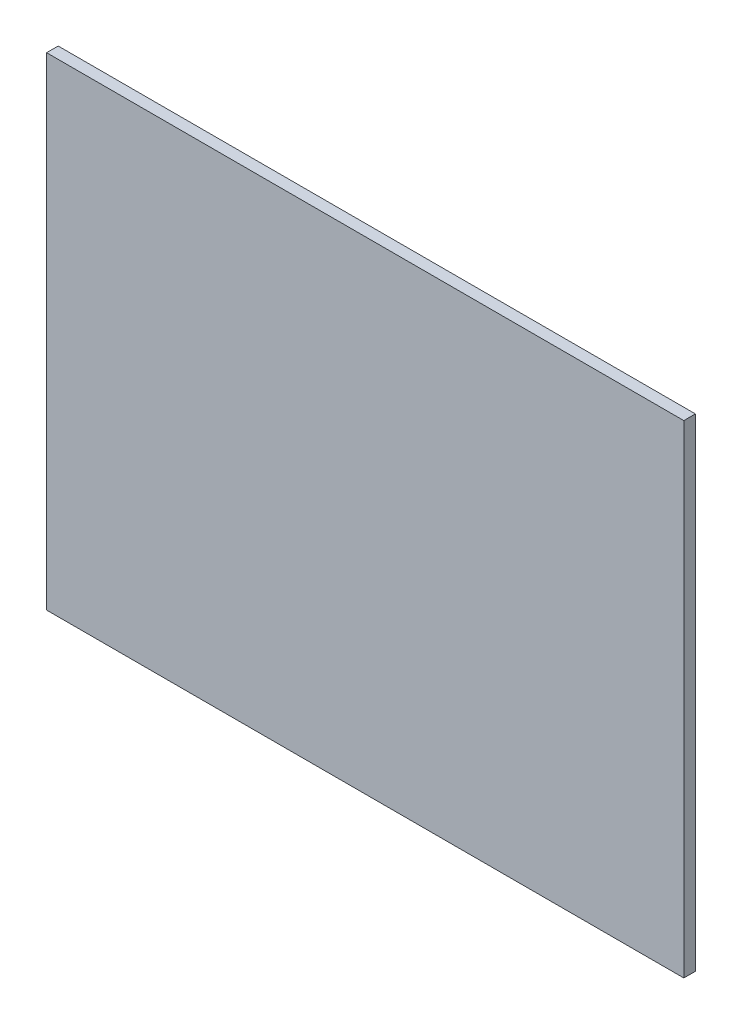
ISO-10303-21;
HEADER;
FILE_DESCRIPTION(('STEP AP214'),'2;1');
FILE_NAME('part.step','',(''),(''),'','','');
FILE_SCHEMA(('AUTOMOTIVE_DESIGN { 1 0 10303 214 1 1 1 1 }'));
ENDSEC;
DATA;
#1=APPLICATION_CONTEXT('core data for automotive mechanical design processes');
#2=APPLICATION_PROTOCOL_DEFINITION('international standard','automotive_design',2000,#1);
#3=PRODUCT_CONTEXT('',#1,'mechanical');
#4=PRODUCT('Part','Part','',(#3));
#5=PRODUCT_RELATED_PRODUCT_CATEGORY('part','',(#4));
#6=PRODUCT_DEFINITION_FORMATION('','',#4);
#7=PRODUCT_DEFINITION_CONTEXT('part definition',#1,'design');
#8=PRODUCT_DEFINITION('design','',#6,#7);
#9=PRODUCT_DEFINITION_SHAPE('','',#8);
#10=(LENGTH_UNIT() NAMED_UNIT(*) SI_UNIT(.MILLI.,.METRE.));
#11=(NAMED_UNIT(*) PLANE_ANGLE_UNIT() SI_UNIT($,.RADIAN.));
#12=(NAMED_UNIT(*) SI_UNIT($,.STERADIAN.) SOLID_ANGLE_UNIT());
#13=UNCERTAINTY_MEASURE_WITH_UNIT(LENGTH_MEASURE(1.E-05),#10,'distance_accuracy_value','');
#14=(GEOMETRIC_REPRESENTATION_CONTEXT(3) GLOBAL_UNCERTAINTY_ASSIGNED_CONTEXT((#13)) GLOBAL_UNIT_ASSIGNED_CONTEXT((#10,
#11,#12)) REPRESENTATION_CONTEXT('',''));
#15=CARTESIAN_POINT('',(0.,0.,0.));
#16=DIRECTION('',(0.,0.,1.));
#17=DIRECTION('',(1.,0.,0.));
#18=AXIS2_PLACEMENT_3D('',#15,#16,#17);
#19=CARTESIAN_POINT('',(-129.236308677098,131.756756756757,6.));
#20=DIRECTION('',(1.,0.,0.));
#21=DIRECTION('',(0.,1.,0.));
#22=AXIS2_PLACEMENT_3D('',#19,#20,#21);
#23=PLANE('',#22);
#24=DIRECTION('',(0.,-1.,0.));
#25=VECTOR('',#24,1.);
#26=CARTESIAN_POINT('',(-129.236308677098,131.756756756757,0.));
#27=LINE('',#26,#25);
#28=CARTESIAN_POINT('',(-129.236308677098,131.756756756757,0.));
#29=VERTEX_POINT('',#28);
#30=CARTESIAN_POINT('',(-129.236308677098,-118.243243243243,0.));
#31=VERTEX_POINT('',#30);
#32=EDGE_CURVE('E96',#29,#31,#27,.T.);
#33=ORIENTED_EDGE('',*,*,#32,.T.);
#34=DIRECTION('',(0.,0.,-1.));
#35=VECTOR('',#34,1.);
#36=CARTESIAN_POINT('',(-129.236308677098,-118.243243243243,6.));
#37=LINE('',#36,#35);
#38=CARTESIAN_POINT('',(-129.236308677098,-118.243243243243,6.));
#39=VERTEX_POINT('',#38);
#40=EDGE_CURVE('E11',#39,#31,#37,.T.);
#41=ORIENTED_EDGE('',*,*,#40,.F.);
#42=DIRECTION('',(0.,-1.,0.));
#43=VECTOR('',#42,1.);
#44=CARTESIAN_POINT('',(-129.236308677098,131.756756756757,6.));
#45=LINE('',#44,#43);
#46=CARTESIAN_POINT('',(-129.236308677098,131.756756756757,6.));
#47=VERTEX_POINT('',#46);
#48=EDGE_CURVE('E84',#47,#39,#45,.T.);
#49=ORIENTED_EDGE('',*,*,#48,.F.);
#50=DIRECTION('',(0.,0.,-1.));
#51=VECTOR('',#50,1.);
#52=CARTESIAN_POINT('',(-129.236308677098,131.756756756757,6.));
#53=LINE('',#52,#51);
#54=EDGE_CURVE('E92',#47,#29,#53,.T.);
#55=ORIENTED_EDGE('',*,*,#54,.T.);
#56=EDGE_LOOP('',(#33,#41,#49,#55));
#57=FACE_BOUND('',#56,.T.);
#58=ADVANCED_FACE('F33',(#57),#23,.F.);
#59=CARTESIAN_POINT('',(-129.236308677098,-118.243243243243,6.));
#60=DIRECTION('',(0.,1.,0.));
#61=DIRECTION('',(-1.,0.,0.));
#62=AXIS2_PLACEMENT_3D('',#59,#60,#61);
#63=PLANE('',#62);
#64=DIRECTION('',(1.,0.,0.));
#65=VECTOR('',#64,1.);
#66=CARTESIAN_POINT('',(-129.236308677098,-118.243243243243,0.));
#67=LINE('',#66,#65);
#68=CARTESIAN_POINT('',(200.763691322902,-118.243243243243,0.));
#69=VERTEX_POINT('',#68);
#70=EDGE_CURVE('E88',#31,#69,#67,.T.);
#71=ORIENTED_EDGE('',*,*,#70,.T.);
#72=DIRECTION('',(0.,0.,-1.));
#73=VECTOR('',#72,1.);
#74=CARTESIAN_POINT('',(200.763691322902,-118.243243243243,6.));
#75=LINE('',#74,#73);
#76=CARTESIAN_POINT('',(200.763691322902,-118.243243243243,6.));
#77=VERTEX_POINT('',#76);
#78=EDGE_CURVE('E41',#77,#69,#75,.T.);
#79=ORIENTED_EDGE('',*,*,#78,.F.);
#80=DIRECTION('',(1.,0.,0.));
#81=VECTOR('',#80,1.);
#82=CARTESIAN_POINT('',(-129.236308677098,-118.243243243243,6.));
#83=LINE('',#82,#81);
#84=EDGE_CURVE('E79',#39,#77,#83,.T.);
#85=ORIENTED_EDGE('',*,*,#84,.F.);
#86=ORIENTED_EDGE('',*,*,#40,.T.);
#87=EDGE_LOOP('',(#71,#79,#85,#86));
#88=FACE_BOUND('',#87,.T.);
#89=ADVANCED_FACE('F87',(#88),#63,.F.);
#90=CARTESIAN_POINT('',(200.763691322902,131.756756756757,6.));
#91=DIRECTION('',(-1.,0.,0.));
#92=DIRECTION('',(0.,-1.,0.));
#93=AXIS2_PLACEMENT_3D('',#90,#91,#92);
#94=PLANE('',#93);
#95=DIRECTION('',(0.,1.,0.));
#96=VECTOR('',#95,1.);
#97=CARTESIAN_POINT('',(200.763691322902,131.756756756757,0.));
#98=LINE('',#97,#96);
#99=CARTESIAN_POINT('',(200.763691322902,131.756756756757,0.));
#100=VERTEX_POINT('',#99);
#101=EDGE_CURVE('E66',#69,#100,#98,.T.);
#102=ORIENTED_EDGE('',*,*,#101,.T.);
#103=DIRECTION('',(0.,0.,-1.));
#104=VECTOR('',#103,1.);
#105=CARTESIAN_POINT('',(200.763691322902,131.756756756757,6.));
#106=LINE('',#105,#104);
#107=CARTESIAN_POINT('',(200.763691322902,131.756756756757,6.));
#108=VERTEX_POINT('',#107);
#109=EDGE_CURVE('E89',#108,#100,#106,.T.);
#110=ORIENTED_EDGE('',*,*,#109,.F.);
#111=DIRECTION('',(0.,1.,0.));
#112=VECTOR('',#111,1.);
#113=CARTESIAN_POINT('',(200.763691322902,131.756756756757,6.));
#114=LINE('',#113,#112);
#115=EDGE_CURVE('E82',#77,#108,#114,.T.);
#116=ORIENTED_EDGE('',*,*,#115,.F.);
#117=ORIENTED_EDGE('',*,*,#78,.T.);
#118=EDGE_LOOP('',(#102,#110,#116,#117));
#119=FACE_BOUND('',#118,.T.);
#120=ADVANCED_FACE('F90',(#119),#94,.F.);
#121=CARTESIAN_POINT('',(-129.236308677098,131.756756756757,6.));
#122=DIRECTION('',(0.,-1.,0.));
#123=DIRECTION('',(0.,0.,-1.));
#124=AXIS2_PLACEMENT_3D('',#121,#122,#123);
#125=PLANE('',#124);
#126=DIRECTION('',(-1.,0.,0.));
#127=VECTOR('',#126,1.);
#128=CARTESIAN_POINT('',(-129.236308677098,131.756756756757,0.));
#129=LINE('',#128,#127);
#130=EDGE_CURVE('E72',#100,#29,#129,.T.);
#131=ORIENTED_EDGE('',*,*,#130,.T.);
#132=ORIENTED_EDGE('',*,*,#54,.F.);
#133=DIRECTION('',(-1.,0.,0.));
#134=VECTOR('',#133,1.);
#135=CARTESIAN_POINT('',(-129.236308677098,131.756756756757,6.));
#136=LINE('',#135,#134);
#137=EDGE_CURVE('E49',#108,#47,#136,.T.);
#138=ORIENTED_EDGE('',*,*,#137,.F.);
#139=ORIENTED_EDGE('',*,*,#109,.T.);
#140=EDGE_LOOP('',(#131,#132,#138,#139));
#141=FACE_BOUND('',#140,.T.);
#142=ADVANCED_FACE('F103',(#141),#125,.F.);
#143=CARTESIAN_POINT('',(0.,0.,6.));
#144=DIRECTION('',(0.,0.,1.));
#145=DIRECTION('',(1.,0.,0.));
#146=AXIS2_PLACEMENT_3D('',#143,#144,#145);
#147=PLANE('',#146);
#148=ORIENTED_EDGE('',*,*,#48,.T.);
#149=ORIENTED_EDGE('',*,*,#84,.T.);
#150=ORIENTED_EDGE('',*,*,#115,.T.);
#151=ORIENTED_EDGE('',*,*,#137,.T.);
#152=EDGE_LOOP('',(#148,#149,#150,#151));
#153=FACE_BOUND('',#152,.T.);
#154=ADVANCED_FACE('F80',(#153),#147,.T.);
#155=CARTESIAN_POINT('',(0.,0.,0.));
#156=DIRECTION('',(0.,0.,1.));
#157=DIRECTION('',(1.,0.,0.));
#158=AXIS2_PLACEMENT_3D('',#155,#156,#157);
#159=PLANE('',#158);
#160=ORIENTED_EDGE('',*,*,#32,.F.);
#161=ORIENTED_EDGE('',*,*,#130,.F.);
#162=ORIENTED_EDGE('',*,*,#101,.F.);
#163=ORIENTED_EDGE('',*,*,#70,.F.);
#164=EDGE_LOOP('',(#160,#161,#162,#163));
#165=FACE_BOUND('',#164,.T.);
#166=ADVANCED_FACE('F106',(#165),#159,.F.);
#167=CLOSED_SHELL('',(#58,#89,#120,#142,#154,#166));
#168=MANIFOLD_SOLID_BREP('B2',#167);
#169=ADVANCED_BREP_SHAPE_REPRESENTATION('',(#18,#168),#14);
#170=SHAPE_DEFINITION_REPRESENTATION(#9,#169);
ENDSEC;
END-ISO-10303-21;
